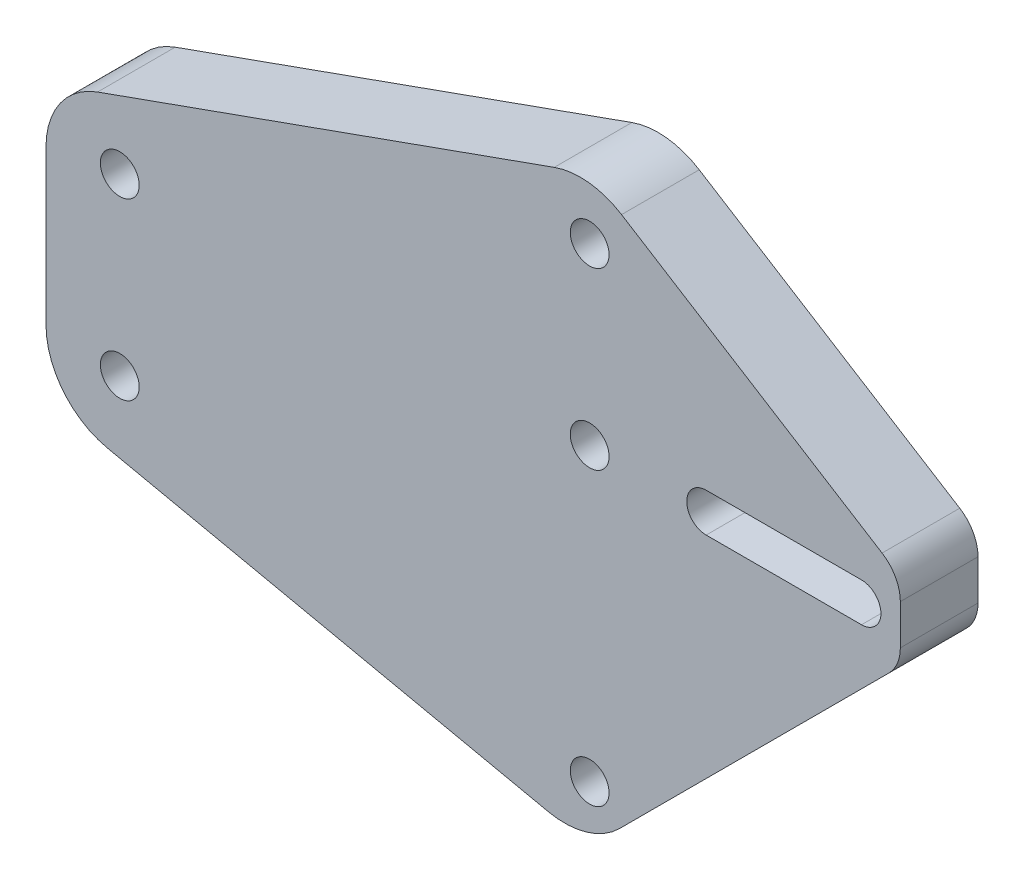
ISO-10303-21;
HEADER;
FILE_DESCRIPTION(('STEP AP214'),'2;1');
FILE_NAME('part.step','',(''),(''),'','','');
FILE_SCHEMA(('AUTOMOTIVE_DESIGN { 1 0 10303 214 1 1 1 1 }'));
ENDSEC;
DATA;
#1=APPLICATION_CONTEXT('core data for automotive mechanical design processes');
#2=APPLICATION_PROTOCOL_DEFINITION('international standard','automotive_design',2000,#1);
#3=PRODUCT_CONTEXT('',#1,'mechanical');
#4=PRODUCT('Part','Part','',(#3));
#5=PRODUCT_RELATED_PRODUCT_CATEGORY('part','',(#4));
#6=PRODUCT_DEFINITION_FORMATION('','',#4);
#7=PRODUCT_DEFINITION_CONTEXT('part definition',#1,'design');
#8=PRODUCT_DEFINITION('design','',#6,#7);
#9=PRODUCT_DEFINITION_SHAPE('','',#8);
#10=(LENGTH_UNIT() NAMED_UNIT(*) SI_UNIT(.MILLI.,.METRE.));
#11=(NAMED_UNIT(*) PLANE_ANGLE_UNIT() SI_UNIT($,.RADIAN.));
#12=(NAMED_UNIT(*) SI_UNIT($,.STERADIAN.) SOLID_ANGLE_UNIT());
#13=UNCERTAINTY_MEASURE_WITH_UNIT(LENGTH_MEASURE(1.E-05),#10,'distance_accuracy_value','');
#14=(GEOMETRIC_REPRESENTATION_CONTEXT(3) GLOBAL_UNCERTAINTY_ASSIGNED_CONTEXT((#13)) GLOBAL_UNIT_ASSIGNED_CONTEXT((#10,
#11,#12)) REPRESENTATION_CONTEXT('',''));
#15=CARTESIAN_POINT('',(0.,0.,0.));
#16=DIRECTION('',(0.,0.,1.));
#17=DIRECTION('',(1.,0.,0.));
#18=AXIS2_PLACEMENT_3D('',#15,#16,#17);
#19=CARTESIAN_POINT('',(-41.1951987154768,23.9545227821022,10.));
#20=DIRECTION('',(0.,0.,1.));
#21=DIRECTION('',(1.,0.,0.));
#22=AXIS2_PLACEMENT_3D('',#19,#20,#21);
#23=PLANE('',#22);
#24=CARTESIAN_POINT('',(-100.5,-17.850085197835,10.));
#25=DIRECTION('',(0.,0.,1.));
#26=DIRECTION('',(1.,0.,0.));
#27=AXIS2_PLACEMENT_3D('',#24,#25,#26);
#28=CIRCLE('',#27,2.5);
#29=CARTESIAN_POINT('',(-98.,-17.850085197835,10.));
#30=VERTEX_POINT('',#29);
#31=EDGE_CURVE('E601',#30,#30,#28,.T.);
#32=ORIENTED_EDGE('',*,*,#31,.F.);
#33=EDGE_LOOP('',(#32));
#34=FACE_BOUND('',#33,.T.);
#35=CARTESIAN_POINT('',(-40.,27.149914802165,10.));
#36=DIRECTION('',(0.,0.,1.));
#37=DIRECTION('',(1.,0.,0.));
#38=AXIS2_PLACEMENT_3D('',#35,#36,#37);
#39=CIRCLE('',#38,2.5);
#40=CARTESIAN_POINT('',(-37.5,27.149914802165,10.));
#41=VERTEX_POINT('',#40);
#42=EDGE_CURVE('E188',#41,#41,#39,.T.);
#43=ORIENTED_EDGE('',*,*,#42,.F.);
#44=EDGE_LOOP('',(#43));
#45=FACE_BOUND('',#44,.T.);
#46=CARTESIAN_POINT('',(-41.1951987154768,23.9545227821022,10.));
#47=DIRECTION('',(0.,0.,1.));
#48=DIRECTION('',(1.,0.,0.));
#49=AXIS2_PLACEMENT_3D('',#46,#47,#48);
#50=CIRCLE('',#49,10.);
#51=CARTESIAN_POINT('',(-35.895209315445,32.4345058221531,10.));
#52=VERTEX_POINT('',#51);
#53=CARTESIAN_POINT('',(-44.5585626854584,33.3719418980506,10.));
#54=VERTEX_POINT('',#53);
#55=EDGE_CURVE('E212',#52,#54,#50,.T.);
#56=ORIENTED_EDGE('',*,*,#55,.T.);
#57=DIRECTION('',(-0.941741911594837,-0.336336396998156,0.));
#58=VECTOR('',#57,1.);
#59=CARTESIAN_POINT('',(-44.5585626854584,33.3719418980506,10.));
#60=LINE('',#59,#58);
#61=CARTESIAN_POINT('',(-103.363363969982,12.370227153578,10.));
#62=VERTEX_POINT('',#61);
#63=EDGE_CURVE('E216',#54,#62,#60,.T.);
#64=ORIENTED_EDGE('',*,*,#63,.T.);
#65=CARTESIAN_POINT('',(-100.,2.95280803762964,10.));
#66=DIRECTION('',(0.,0.,1.));
#67=DIRECTION('',(1.,0.,0.));
#68=AXIS2_PLACEMENT_3D('',#65,#66,#67);
#69=CIRCLE('',#68,9.99999999999998);
#70=CARTESIAN_POINT('',(-110.,2.95280803762964,10.));
#71=VERTEX_POINT('',#70);
#72=EDGE_CURVE('E220',#62,#71,#69,.T.);
#73=ORIENTED_EDGE('',*,*,#72,.T.);
#74=DIRECTION('',(0.,-1.,0.));
#75=VECTOR('',#74,1.);
#76=CARTESIAN_POINT('',(-110.,2.95280803762964,10.));
#77=LINE('',#76,#75);
#78=CARTESIAN_POINT('',(-110.,-16.9158420976597,10.));
#79=VERTEX_POINT('',#78);
#80=EDGE_CURVE('E223',#71,#79,#77,.T.);
#81=ORIENTED_EDGE('',*,*,#80,.T.);
#82=CARTESIAN_POINT('',(-100.,-16.9158420976597,10.));
#83=DIRECTION('',(0.,0.,1.));
#84=DIRECTION('',(1.,0.,0.));
#85=AXIS2_PLACEMENT_3D('',#82,#83,#84);
#86=CIRCLE('',#85,10.);
#87=CARTESIAN_POINT('',(-102.095290887309,-26.6938662384338,10.));
#88=VERTEX_POINT('',#87);
#89=EDGE_CURVE('E226',#79,#88,#86,.T.);
#90=ORIENTED_EDGE('',*,*,#89,.T.);
#91=DIRECTION('',(0.97780241407741,-0.209529088730873,0.));
#92=VECTOR('',#91,1.);
#93=CARTESIAN_POINT('',(-102.095290887309,-26.6938662384338,10.));
#94=LINE('',#93,#92);
#95=CARTESIAN_POINT('',(-45.3195078343364,-38.8601054640708,10.));
#96=VERTEX_POINT('',#95);
#97=EDGE_CURVE('E229',#88,#96,#94,.T.);
#98=ORIENTED_EDGE('',*,*,#97,.T.);
#99=CARTESIAN_POINT('',(-43.2242169470276,-29.0820813232967,10.));
#100=DIRECTION('',(0.,0.,1.));
#101=DIRECTION('',(1.,0.,0.));
#102=AXIS2_PLACEMENT_3D('',#99,#100,#101);
#103=CIRCLE('',#102,10.);
#104=CARTESIAN_POINT('',(-36.1531491351622,-36.1531491351622,10.));
#105=VERTEX_POINT('',#104);
#106=EDGE_CURVE('E232',#96,#105,#103,.T.);
#107=ORIENTED_EDGE('',*,*,#106,.T.);
#108=DIRECTION('',(0.707106781186547,0.707106781186548,0.));
#109=VECTOR('',#108,1.);
#110=CARTESIAN_POINT('',(-36.1531491351622,-36.1531491351622,10.));
#111=LINE('',#110,#109);
#112=CARTESIAN_POINT('',(-1.46446609406726,-1.46446609406727,10.));
#113=VERTEX_POINT('',#112);
#114=EDGE_CURVE('E235',#105,#113,#111,.T.);
#115=ORIENTED_EDGE('',*,*,#114,.T.);
#116=CARTESIAN_POINT('',(-5.,2.07106781186547,10.));
#117=DIRECTION('',(0.,0.,1.));
#118=DIRECTION('',(-1.,0.,0.));
#119=AXIS2_PLACEMENT_3D('',#116,#117,#118);
#120=CIRCLE('',#119,5.);
#121=CARTESIAN_POINT('',(0.,2.07106781186547,10.));
#122=VERTEX_POINT('',#121);
#123=EDGE_CURVE('E238',#113,#122,#120,.T.);
#124=ORIENTED_EDGE('',*,*,#123,.T.);
#125=DIRECTION('',(0.,1.,0.));
#126=VECTOR('',#125,1.);
#127=CARTESIAN_POINT('',(0.,7.22876179246463,10.));
#128=LINE('',#127,#126);
#129=CARTESIAN_POINT('',(0.,7.22876179246463,10.));
#130=VERTEX_POINT('',#129);
#131=EDGE_CURVE('E241',#122,#130,#128,.T.);
#132=ORIENTED_EDGE('',*,*,#131,.T.);
#133=CARTESIAN_POINT('',(-5.,7.22876179246463,10.));
#134=DIRECTION('',(0.,0.,1.));
#135=DIRECTION('',(-1.,0.,0.));
#136=AXIS2_PLACEMENT_3D('',#133,#134,#135);
#137=CIRCLE('',#136,5.);
#138=CARTESIAN_POINT('',(-2.3500052999841,11.4687533124901,10.));
#139=VERTEX_POINT('',#138);
#140=EDGE_CURVE('E244',#130,#139,#137,.T.);
#141=ORIENTED_EDGE('',*,*,#140,.T.);
#142=DIRECTION('',(-0.847998304005088,0.52999894000318,0.));
#143=VECTOR('',#142,1.);
#144=CARTESIAN_POINT('',(-35.895209315445,32.4345058221531,10.));
#145=LINE('',#144,#143);
#146=EDGE_CURVE('E247',#139,#52,#145,.T.);
#147=ORIENTED_EDGE('',*,*,#146,.T.);
#148=EDGE_LOOP('',(#56,#64,#73,#81,#90,#98,#107,#115,#124,#132,#141,#147));
#149=FACE_BOUND('',#148,.T.);
#150=CARTESIAN_POINT('',(-40.,4.64991480216505,10.));
#151=DIRECTION('',(0.,0.,1.));
#152=DIRECTION('',(1.,0.,0.));
#153=AXIS2_PLACEMENT_3D('',#150,#151,#152);
#154=CIRCLE('',#153,2.5);
#155=CARTESIAN_POINT('',(-37.5,4.64991480216505,10.));
#156=VERTEX_POINT('',#155);
#157=EDGE_CURVE('E204',#156,#156,#154,.T.);
#158=ORIENTED_EDGE('',*,*,#157,.F.);
#159=EDGE_LOOP('',(#158));
#160=FACE_BOUND('',#159,.T.);
#161=DIRECTION('',(1.,0.,0.));
#162=VECTOR('',#161,1.);
#163=CARTESIAN_POINT('',(-25.,2.14991480216505,10.));
#164=LINE('',#163,#162);
#165=CARTESIAN_POINT('',(-25.,2.14991480216505,10.));
#166=VERTEX_POINT('',#165);
#167=CARTESIAN_POINT('',(-5.,2.14991480216504,10.));
#168=VERTEX_POINT('',#167);
#169=EDGE_CURVE('E162',#166,#168,#164,.T.);
#170=ORIENTED_EDGE('',*,*,#169,.F.);
#171=CARTESIAN_POINT('',(-25.,4.64991480216505,10.));
#172=DIRECTION('',(0.,0.,1.));
#173=DIRECTION('',(1.,0.,0.));
#174=AXIS2_PLACEMENT_3D('',#171,#172,#173);
#175=CIRCLE('',#174,2.5);
#176=CARTESIAN_POINT('',(-25.,7.14991480216505,10.));
#177=VERTEX_POINT('',#176);
#178=EDGE_CURVE('E153',#177,#166,#175,.T.);
#179=ORIENTED_EDGE('',*,*,#178,.F.);
#180=DIRECTION('',(-1.,0.,0.));
#181=VECTOR('',#180,1.);
#182=CARTESIAN_POINT('',(-25.,7.14991480216505,10.));
#183=LINE('',#182,#181);
#184=CARTESIAN_POINT('',(-5.,7.14991480216505,10.));
#185=VERTEX_POINT('',#184);
#186=EDGE_CURVE('E180',#185,#177,#183,.T.);
#187=ORIENTED_EDGE('',*,*,#186,.F.);
#188=CARTESIAN_POINT('',(-5.,4.64991480216505,10.));
#189=DIRECTION('',(0.,0.,1.));
#190=DIRECTION('',(1.,0.,0.));
#191=AXIS2_PLACEMENT_3D('',#188,#189,#190);
#192=CIRCLE('',#191,2.5);
#193=EDGE_CURVE('E176',#168,#185,#192,.T.);
#194=ORIENTED_EDGE('',*,*,#193,.F.);
#195=EDGE_LOOP('',(#170,#179,#187,#194));
#196=FACE_BOUND('',#195,.T.);
#197=CARTESIAN_POINT('',(-100.5,4.64991480216505,10.));
#198=DIRECTION('',(0.,0.,1.));
#199=DIRECTION('',(1.,0.,0.));
#200=AXIS2_PLACEMENT_3D('',#197,#198,#199);
#201=CIRCLE('',#200,2.5);
#202=CARTESIAN_POINT('',(-98.,4.64991480216505,10.));
#203=VERTEX_POINT('',#202);
#204=EDGE_CURVE('E609',#203,#203,#201,.T.);
#205=ORIENTED_EDGE('',*,*,#204,.F.);
#206=EDGE_LOOP('',(#205));
#207=FACE_BOUND('',#206,.T.);
#208=CARTESIAN_POINT('',(-40.,-32.850085197835,10.));
#209=DIRECTION('',(0.,0.,1.));
#210=DIRECTION('',(1.,0.,0.));
#211=AXIS2_PLACEMENT_3D('',#208,#209,#210);
#212=CIRCLE('',#211,2.5);
#213=CARTESIAN_POINT('',(-37.5,-32.850085197835,10.));
#214=VERTEX_POINT('',#213);
#215=EDGE_CURVE('E590',#214,#214,#212,.T.);
#216=ORIENTED_EDGE('',*,*,#215,.F.);
#217=EDGE_LOOP('',(#216));
#218=FACE_BOUND('',#217,.T.);
#219=ADVANCED_FACE('F39',(#34,#45,#149,#160,#196,#207,#218),#23,.T.);
#220=CARTESIAN_POINT('',(-41.1951987154768,23.9545227821022,0.));
#221=DIRECTION('',(0.,0.,1.));
#222=DIRECTION('',(1.,0.,0.));
#223=AXIS2_PLACEMENT_3D('',#220,#221,#222);
#224=PLANE('',#223);
#225=CARTESIAN_POINT('',(-40.,4.64991480216505,0.));
#226=DIRECTION('',(0.,0.,1.));
#227=DIRECTION('',(1.,0.,0.));
#228=AXIS2_PLACEMENT_3D('',#225,#226,#227);
#229=CIRCLE('',#228,2.5);
#230=CARTESIAN_POINT('',(-37.5,4.64991480216505,0.));
#231=VERTEX_POINT('',#230);
#232=EDGE_CURVE('E171',#231,#231,#229,.T.);
#233=ORIENTED_EDGE('',*,*,#232,.T.);
#234=EDGE_LOOP('',(#233));
#235=FACE_BOUND('',#234,.T.);
#236=CARTESIAN_POINT('',(-41.1951987154768,23.9545227821022,0.));
#237=DIRECTION('',(0.,0.,1.));
#238=DIRECTION('',(1.,0.,0.));
#239=AXIS2_PLACEMENT_3D('',#236,#237,#238);
#240=CIRCLE('',#239,10.);
#241=CARTESIAN_POINT('',(-35.895209315445,32.4345058221531,0.));
#242=VERTEX_POINT('',#241);
#243=CARTESIAN_POINT('',(-44.5585626854584,33.3719418980506,0.));
#244=VERTEX_POINT('',#243);
#245=EDGE_CURVE('E208',#242,#244,#240,.T.);
#246=ORIENTED_EDGE('',*,*,#245,.F.);
#247=DIRECTION('',(-0.847998304005088,0.52999894000318,0.));
#248=VECTOR('',#247,1.);
#249=CARTESIAN_POINT('',(-35.895209315445,32.4345058221531,0.));
#250=LINE('',#249,#248);
#251=CARTESIAN_POINT('',(-2.3500052999841,11.4687533124901,0.));
#252=VERTEX_POINT('',#251);
#253=EDGE_CURVE('E217',#252,#242,#250,.T.);
#254=ORIENTED_EDGE('',*,*,#253,.F.);
#255=CARTESIAN_POINT('',(-5.,7.22876179246463,0.));
#256=DIRECTION('',(0.,0.,1.));
#257=DIRECTION('',(-1.,0.,0.));
#258=AXIS2_PLACEMENT_3D('',#255,#256,#257);
#259=CIRCLE('',#258,5.);
#260=CARTESIAN_POINT('',(0.,7.22876179246463,0.));
#261=VERTEX_POINT('',#260);
#262=EDGE_CURVE('E281',#261,#252,#259,.T.);
#263=ORIENTED_EDGE('',*,*,#262,.F.);
#264=DIRECTION('',(0.,1.,0.));
#265=VECTOR('',#264,1.);
#266=CARTESIAN_POINT('',(0.,7.22876179246463,0.));
#267=LINE('',#266,#265);
#268=CARTESIAN_POINT('',(0.,2.07106781186547,0.));
#269=VERTEX_POINT('',#268);
#270=EDGE_CURVE('E278',#269,#261,#267,.T.);
#271=ORIENTED_EDGE('',*,*,#270,.F.);
#272=CARTESIAN_POINT('',(-5.,2.07106781186547,0.));
#273=DIRECTION('',(0.,0.,1.));
#274=DIRECTION('',(-1.,0.,0.));
#275=AXIS2_PLACEMENT_3D('',#272,#273,#274);
#276=CIRCLE('',#275,5.);
#277=CARTESIAN_POINT('',(-1.46446609406726,-1.46446609406727,0.));
#278=VERTEX_POINT('',#277);
#279=EDGE_CURVE('E275',#278,#269,#276,.T.);
#280=ORIENTED_EDGE('',*,*,#279,.F.);
#281=DIRECTION('',(0.707106781186547,0.707106781186548,0.));
#282=VECTOR('',#281,1.);
#283=CARTESIAN_POINT('',(-36.1531491351622,-36.1531491351622,0.));
#284=LINE('',#283,#282);
#285=CARTESIAN_POINT('',(-36.1531491351622,-36.1531491351622,0.));
#286=VERTEX_POINT('',#285);
#287=EDGE_CURVE('E272',#286,#278,#284,.T.);
#288=ORIENTED_EDGE('',*,*,#287,.F.);
#289=CARTESIAN_POINT('',(-43.2242169470276,-29.0820813232967,0.));
#290=DIRECTION('',(0.,0.,1.));
#291=DIRECTION('',(1.,0.,0.));
#292=AXIS2_PLACEMENT_3D('',#289,#290,#291);
#293=CIRCLE('',#292,10.);
#294=CARTESIAN_POINT('',(-45.3195078343364,-38.8601054640708,0.));
#295=VERTEX_POINT('',#294);
#296=EDGE_CURVE('E269',#295,#286,#293,.T.);
#297=ORIENTED_EDGE('',*,*,#296,.F.);
#298=DIRECTION('',(0.97780241407741,-0.209529088730873,0.));
#299=VECTOR('',#298,1.);
#300=CARTESIAN_POINT('',(-102.095290887309,-26.6938662384338,0.));
#301=LINE('',#300,#299);
#302=CARTESIAN_POINT('',(-102.095290887309,-26.6938662384338,0.));
#303=VERTEX_POINT('',#302);
#304=EDGE_CURVE('E266',#303,#295,#301,.T.);
#305=ORIENTED_EDGE('',*,*,#304,.F.);
#306=CARTESIAN_POINT('',(-100.,-16.9158420976597,0.));
#307=DIRECTION('',(0.,0.,1.));
#308=DIRECTION('',(1.,0.,0.));
#309=AXIS2_PLACEMENT_3D('',#306,#307,#308);
#310=CIRCLE('',#309,10.);
#311=CARTESIAN_POINT('',(-110.,-16.9158420976597,0.));
#312=VERTEX_POINT('',#311);
#313=EDGE_CURVE('E263',#312,#303,#310,.T.);
#314=ORIENTED_EDGE('',*,*,#313,.F.);
#315=DIRECTION('',(0.,-1.,0.));
#316=VECTOR('',#315,1.);
#317=CARTESIAN_POINT('',(-110.,2.95280803762964,0.));
#318=LINE('',#317,#316);
#319=CARTESIAN_POINT('',(-110.,2.95280803762964,0.));
#320=VERTEX_POINT('',#319);
#321=EDGE_CURVE('E260',#320,#312,#318,.T.);
#322=ORIENTED_EDGE('',*,*,#321,.F.);
#323=CARTESIAN_POINT('',(-100.,2.95280803762964,0.));
#324=DIRECTION('',(0.,0.,1.));
#325=DIRECTION('',(1.,0.,0.));
#326=AXIS2_PLACEMENT_3D('',#323,#324,#325);
#327=CIRCLE('',#326,9.99999999999998);
#328=CARTESIAN_POINT('',(-103.363363969982,12.370227153578,0.));
#329=VERTEX_POINT('',#328);
#330=EDGE_CURVE('E257',#329,#320,#327,.T.);
#331=ORIENTED_EDGE('',*,*,#330,.F.);
#332=DIRECTION('',(-0.941741911594837,-0.336336396998156,0.));
#333=VECTOR('',#332,1.);
#334=CARTESIAN_POINT('',(-44.5585626854584,33.3719418980506,0.));
#335=LINE('',#334,#333);
#336=EDGE_CURVE('E254',#244,#329,#335,.T.);
#337=ORIENTED_EDGE('',*,*,#336,.F.);
#338=EDGE_LOOP('',(#246,#254,#263,#271,#280,#288,#297,#305,#314,#322,#331,#337));
#339=FACE_BOUND('',#338,.T.);
#340=CARTESIAN_POINT('',(-25.,4.64991480216505,0.));
#341=DIRECTION('',(0.,0.,1.));
#342=DIRECTION('',(1.,0.,0.));
#343=AXIS2_PLACEMENT_3D('',#340,#341,#342);
#344=CIRCLE('',#343,2.5);
#345=CARTESIAN_POINT('',(-25.,7.14991480216505,0.));
#346=VERTEX_POINT('',#345);
#347=CARTESIAN_POINT('',(-25.,2.14991480216505,0.));
#348=VERTEX_POINT('',#347);
#349=EDGE_CURVE('E63',#346,#348,#344,.T.);
#350=ORIENTED_EDGE('',*,*,#349,.T.);
#351=DIRECTION('',(1.,0.,0.));
#352=VECTOR('',#351,1.);
#353=CARTESIAN_POINT('',(-25.,2.14991480216505,0.));
#354=LINE('',#353,#352);
#355=CARTESIAN_POINT('',(-5.,2.14991480216504,0.));
#356=VERTEX_POINT('',#355);
#357=EDGE_CURVE('E169',#348,#356,#354,.T.);
#358=ORIENTED_EDGE('',*,*,#357,.T.);
#359=CARTESIAN_POINT('',(-5.,4.64991480216505,0.));
#360=DIRECTION('',(0.,0.,1.));
#361=DIRECTION('',(1.,0.,0.));
#362=AXIS2_PLACEMENT_3D('',#359,#360,#361);
#363=CIRCLE('',#362,2.5);
#364=CARTESIAN_POINT('',(-5.,7.14991480216505,0.));
#365=VERTEX_POINT('',#364);
#366=EDGE_CURVE('E191',#356,#365,#363,.T.);
#367=ORIENTED_EDGE('',*,*,#366,.T.);
#368=DIRECTION('',(-1.,0.,0.));
#369=VECTOR('',#368,1.);
#370=CARTESIAN_POINT('',(-25.,7.14991480216505,0.));
#371=LINE('',#370,#369);
#372=EDGE_CURVE('E163',#365,#346,#371,.T.);
#373=ORIENTED_EDGE('',*,*,#372,.T.);
#374=EDGE_LOOP('',(#350,#358,#367,#373));
#375=FACE_BOUND('',#374,.T.);
#376=CARTESIAN_POINT('',(-40.,27.149914802165,0.));
#377=DIRECTION('',(0.,0.,1.));
#378=DIRECTION('',(1.,0.,0.));
#379=AXIS2_PLACEMENT_3D('',#376,#377,#378);
#380=CIRCLE('',#379,2.5);
#381=CARTESIAN_POINT('',(-37.5,27.149914802165,0.));
#382=VERTEX_POINT('',#381);
#383=EDGE_CURVE('E613',#382,#382,#380,.T.);
#384=ORIENTED_EDGE('',*,*,#383,.T.);
#385=EDGE_LOOP('',(#384));
#386=FACE_BOUND('',#385,.T.);
#387=CARTESIAN_POINT('',(-100.5,4.64991480216505,0.));
#388=DIRECTION('',(0.,0.,1.));
#389=DIRECTION('',(1.,0.,0.));
#390=AXIS2_PLACEMENT_3D('',#387,#388,#389);
#391=CIRCLE('',#390,2.5);
#392=CARTESIAN_POINT('',(-98.,4.64991480216505,0.));
#393=VERTEX_POINT('',#392);
#394=EDGE_CURVE('E605',#393,#393,#391,.T.);
#395=ORIENTED_EDGE('',*,*,#394,.T.);
#396=EDGE_LOOP('',(#395));
#397=FACE_BOUND('',#396,.T.);
#398=CARTESIAN_POINT('',(-100.5,-17.850085197835,0.));
#399=DIRECTION('',(0.,0.,1.));
#400=DIRECTION('',(1.,0.,0.));
#401=AXIS2_PLACEMENT_3D('',#398,#399,#400);
#402=CIRCLE('',#401,2.5);
#403=CARTESIAN_POINT('',(-98.,-17.850085197835,0.));
#404=VERTEX_POINT('',#403);
#405=EDGE_CURVE('E598',#404,#404,#402,.T.);
#406=ORIENTED_EDGE('',*,*,#405,.T.);
#407=EDGE_LOOP('',(#406));
#408=FACE_BOUND('',#407,.T.);
#409=CARTESIAN_POINT('',(-40.,-32.850085197835,0.));
#410=DIRECTION('',(0.,0.,1.));
#411=DIRECTION('',(1.,0.,0.));
#412=AXIS2_PLACEMENT_3D('',#409,#410,#411);
#413=CIRCLE('',#412,2.5);
#414=CARTESIAN_POINT('',(-37.5,-32.850085197835,0.));
#415=VERTEX_POINT('',#414);
#416=EDGE_CURVE('E593',#415,#415,#413,.T.);
#417=ORIENTED_EDGE('',*,*,#416,.T.);
#418=EDGE_LOOP('',(#417));
#419=FACE_BOUND('',#418,.T.);
#420=ADVANCED_FACE('F336',(#235,#339,#375,#386,#397,#408,#419),#224,.F.);
#421=CARTESIAN_POINT('',(-41.1951987154768,23.9545227821022,10.));
#422=DIRECTION('',(0.,0.,-1.));
#423=DIRECTION('',(-1.,0.,0.));
#424=AXIS2_PLACEMENT_3D('',#421,#422,#423);
#425=CYLINDRICAL_SURFACE('',#424,10.);
#426=ORIENTED_EDGE('',*,*,#245,.T.);
#427=DIRECTION('',(0.,0.,-1.));
#428=VECTOR('',#427,1.);
#429=CARTESIAN_POINT('',(-44.5585626854584,33.3719418980506,10.));
#430=LINE('',#429,#428);
#431=EDGE_CURVE('E11',#54,#244,#430,.T.);
#432=ORIENTED_EDGE('',*,*,#431,.F.);
#433=ORIENTED_EDGE('',*,*,#55,.F.);
#434=DIRECTION('',(0.,0.,-1.));
#435=VECTOR('',#434,1.);
#436=CARTESIAN_POINT('',(-35.895209315445,32.4345058221531,10.));
#437=LINE('',#436,#435);
#438=EDGE_CURVE('E250',#52,#242,#437,.T.);
#439=ORIENTED_EDGE('',*,*,#438,.T.);
#440=EDGE_LOOP('',(#426,#432,#433,#439));
#441=FACE_BOUND('',#440,.T.);
#442=ADVANCED_FACE('F41',(#441),#425,.T.);
#443=CARTESIAN_POINT('',(-44.5585626854584,33.3719418980506,10.));
#444=DIRECTION('',(0.336336396998156,-0.941741911594837,0.));
#445=DIRECTION('',(0.941741911594837,0.336336396998156,0.));
#446=AXIS2_PLACEMENT_3D('',#443,#444,#445);
#447=PLANE('',#446);
#448=ORIENTED_EDGE('',*,*,#336,.T.);
#449=DIRECTION('',(0.,0.,-1.));
#450=VECTOR('',#449,1.);
#451=CARTESIAN_POINT('',(-103.363363969982,12.370227153578,10.));
#452=LINE('',#451,#450);
#453=EDGE_CURVE('E48',#62,#329,#452,.T.);
#454=ORIENTED_EDGE('',*,*,#453,.F.);
#455=ORIENTED_EDGE('',*,*,#63,.F.);
#456=ORIENTED_EDGE('',*,*,#431,.T.);
#457=EDGE_LOOP('',(#448,#454,#455,#456));
#458=FACE_BOUND('',#457,.T.);
#459=ADVANCED_FACE('F354',(#458),#447,.F.);
#460=CARTESIAN_POINT('',(-100.,2.95280803762964,10.));
#461=DIRECTION('',(0.,0.,-1.));
#462=DIRECTION('',(-1.,0.,0.));
#463=AXIS2_PLACEMENT_3D('',#460,#461,#462);
#464=CYLINDRICAL_SURFACE('',#463,9.99999999999998);
#465=ORIENTED_EDGE('',*,*,#330,.T.);
#466=DIRECTION('',(0.,0.,-1.));
#467=VECTOR('',#466,1.);
#468=CARTESIAN_POINT('',(-110.,2.95280803762964,10.));
#469=LINE('',#468,#467);
#470=EDGE_CURVE('E321',#71,#320,#469,.T.);
#471=ORIENTED_EDGE('',*,*,#470,.F.);
#472=ORIENTED_EDGE('',*,*,#72,.F.);
#473=ORIENTED_EDGE('',*,*,#453,.T.);
#474=EDGE_LOOP('',(#465,#471,#472,#473));
#475=FACE_BOUND('',#474,.T.);
#476=ADVANCED_FACE('F330',(#475),#464,.T.);
#477=CARTESIAN_POINT('',(-110.,2.95280803762964,10.));
#478=DIRECTION('',(1.,0.,0.));
#479=DIRECTION('',(0.,1.,0.));
#480=AXIS2_PLACEMENT_3D('',#477,#478,#479);
#481=PLANE('',#480);
#482=ORIENTED_EDGE('',*,*,#321,.T.);
#483=DIRECTION('',(0.,0.,-1.));
#484=VECTOR('',#483,1.);
#485=CARTESIAN_POINT('',(-110.,-16.9158420976597,10.));
#486=LINE('',#485,#484);
#487=EDGE_CURVE('E317',#79,#312,#486,.T.);
#488=ORIENTED_EDGE('',*,*,#487,.F.);
#489=ORIENTED_EDGE('',*,*,#80,.F.);
#490=ORIENTED_EDGE('',*,*,#470,.T.);
#491=EDGE_LOOP('',(#482,#488,#489,#490));
#492=FACE_BOUND('',#491,.T.);
#493=ADVANCED_FACE('F342',(#492),#481,.F.);
#494=CARTESIAN_POINT('',(-100.,-16.9158420976597,10.));
#495=DIRECTION('',(0.,0.,-1.));
#496=DIRECTION('',(-1.,0.,0.));
#497=AXIS2_PLACEMENT_3D('',#494,#495,#496);
#498=CYLINDRICAL_SURFACE('',#497,10.);
#499=ORIENTED_EDGE('',*,*,#313,.T.);
#500=DIRECTION('',(0.,0.,-1.));
#501=VECTOR('',#500,1.);
#502=CARTESIAN_POINT('',(-102.095290887309,-26.6938662384338,10.));
#503=LINE('',#502,#501);
#504=EDGE_CURVE('E313',#88,#303,#503,.T.);
#505=ORIENTED_EDGE('',*,*,#504,.F.);
#506=ORIENTED_EDGE('',*,*,#89,.F.);
#507=ORIENTED_EDGE('',*,*,#487,.T.);
#508=EDGE_LOOP('',(#499,#505,#506,#507));
#509=FACE_BOUND('',#508,.T.);
#510=ADVANCED_FACE('F346',(#509),#498,.T.);
#511=CARTESIAN_POINT('',(-102.095290887309,-26.6938662384338,10.));
#512=DIRECTION('',(0.209529088730873,0.97780241407741,0.));
#513=DIRECTION('',(-0.97780241407741,0.209529088730873,0.));
#514=AXIS2_PLACEMENT_3D('',#511,#512,#513);
#515=PLANE('',#514);
#516=ORIENTED_EDGE('',*,*,#304,.T.);
#517=DIRECTION('',(0.,0.,-1.));
#518=VECTOR('',#517,1.);
#519=CARTESIAN_POINT('',(-45.3195078343364,-38.8601054640708,10.));
#520=LINE('',#519,#518);
#521=EDGE_CURVE('E309',#96,#295,#520,.T.);
#522=ORIENTED_EDGE('',*,*,#521,.F.);
#523=ORIENTED_EDGE('',*,*,#97,.F.);
#524=ORIENTED_EDGE('',*,*,#504,.T.);
#525=EDGE_LOOP('',(#516,#522,#523,#524));
#526=FACE_BOUND('',#525,.T.);
#527=ADVANCED_FACE('F387',(#526),#515,.F.);
#528=CARTESIAN_POINT('',(-43.2242169470276,-29.0820813232967,10.));
#529=DIRECTION('',(0.,0.,-1.));
#530=DIRECTION('',(-1.,0.,0.));
#531=AXIS2_PLACEMENT_3D('',#528,#529,#530);
#532=CYLINDRICAL_SURFACE('',#531,10.);
#533=ORIENTED_EDGE('',*,*,#296,.T.);
#534=DIRECTION('',(0.,0.,-1.));
#535=VECTOR('',#534,1.);
#536=CARTESIAN_POINT('',(-36.1531491351622,-36.1531491351622,10.));
#537=LINE('',#536,#535);
#538=EDGE_CURVE('E305',#105,#286,#537,.T.);
#539=ORIENTED_EDGE('',*,*,#538,.F.);
#540=ORIENTED_EDGE('',*,*,#106,.F.);
#541=ORIENTED_EDGE('',*,*,#521,.T.);
#542=EDGE_LOOP('',(#533,#539,#540,#541));
#543=FACE_BOUND('',#542,.T.);
#544=ADVANCED_FACE('F385',(#543),#532,.T.);
#545=CARTESIAN_POINT('',(-36.1531491351622,-36.1531491351622,10.));
#546=DIRECTION('',(-0.707106781186548,0.707106781186547,0.));
#547=DIRECTION('',(-0.707106781186547,-0.707106781186548,0.));
#548=AXIS2_PLACEMENT_3D('',#545,#546,#547);
#549=PLANE('',#548);
#550=ORIENTED_EDGE('',*,*,#287,.T.);
#551=DIRECTION('',(0.,0.,-1.));
#552=VECTOR('',#551,1.);
#553=CARTESIAN_POINT('',(-1.46446609406726,-1.46446609406727,10.));
#554=LINE('',#553,#552);
#555=EDGE_CURVE('E301',#113,#278,#554,.T.);
#556=ORIENTED_EDGE('',*,*,#555,.F.);
#557=ORIENTED_EDGE('',*,*,#114,.F.);
#558=ORIENTED_EDGE('',*,*,#538,.T.);
#559=EDGE_LOOP('',(#550,#556,#557,#558));
#560=FACE_BOUND('',#559,.T.);
#561=ADVANCED_FACE('F381',(#560),#549,.F.);
#562=CARTESIAN_POINT('',(-5.,2.07106781186547,10.));
#563=DIRECTION('',(0.,0.,-1.));
#564=DIRECTION('',(-1.,0.,0.));
#565=AXIS2_PLACEMENT_3D('',#562,#563,#564);
#566=CYLINDRICAL_SURFACE('',#565,5.);
#567=ORIENTED_EDGE('',*,*,#279,.T.);
#568=DIRECTION('',(0.,0.,-1.));
#569=VECTOR('',#568,1.);
#570=CARTESIAN_POINT('',(0.,2.07106781186547,10.));
#571=LINE('',#570,#569);
#572=EDGE_CURVE('E297',#122,#269,#571,.T.);
#573=ORIENTED_EDGE('',*,*,#572,.F.);
#574=ORIENTED_EDGE('',*,*,#123,.F.);
#575=ORIENTED_EDGE('',*,*,#555,.T.);
#576=EDGE_LOOP('',(#567,#573,#574,#575));
#577=FACE_BOUND('',#576,.T.);
#578=ADVANCED_FACE('F376',(#577),#566,.T.);
#579=CARTESIAN_POINT('',(0.,7.22876179246463,10.));
#580=DIRECTION('',(-1.,0.,0.));
#581=DIRECTION('',(0.,0.,1.));
#582=AXIS2_PLACEMENT_3D('',#579,#580,#581);
#583=PLANE('',#582);
#584=ORIENTED_EDGE('',*,*,#270,.T.);
#585=DIRECTION('',(0.,0.,-1.));
#586=VECTOR('',#585,1.);
#587=CARTESIAN_POINT('',(0.,7.22876179246463,10.));
#588=LINE('',#587,#586);
#589=EDGE_CURVE('E293',#130,#261,#588,.T.);
#590=ORIENTED_EDGE('',*,*,#589,.F.);
#591=ORIENTED_EDGE('',*,*,#131,.F.);
#592=ORIENTED_EDGE('',*,*,#572,.T.);
#593=EDGE_LOOP('',(#584,#590,#591,#592));
#594=FACE_BOUND('',#593,.T.);
#595=ADVANCED_FACE('F370',(#594),#583,.F.);
#596=CARTESIAN_POINT('',(-5.,7.22876179246463,10.));
#597=DIRECTION('',(0.,0.,-1.));
#598=DIRECTION('',(-1.,0.,0.));
#599=AXIS2_PLACEMENT_3D('',#596,#597,#598);
#600=CYLINDRICAL_SURFACE('',#599,5.);
#601=ORIENTED_EDGE('',*,*,#262,.T.);
#602=DIRECTION('',(0.,0.,-1.));
#603=VECTOR('',#602,1.);
#604=CARTESIAN_POINT('',(-2.3500052999841,11.4687533124901,10.));
#605=LINE('',#604,#603);
#606=EDGE_CURVE('E289',#139,#252,#605,.T.);
#607=ORIENTED_EDGE('',*,*,#606,.F.);
#608=ORIENTED_EDGE('',*,*,#140,.F.);
#609=ORIENTED_EDGE('',*,*,#589,.T.);
#610=EDGE_LOOP('',(#601,#607,#608,#609));
#611=FACE_BOUND('',#610,.T.);
#612=ADVANCED_FACE('F366',(#611),#600,.T.);
#613=CARTESIAN_POINT('',(-35.895209315445,32.4345058221531,10.));
#614=DIRECTION('',(-0.52999894000318,-0.847998304005088,0.));
#615=DIRECTION('',(0.847998304005088,-0.52999894000318,0.));
#616=AXIS2_PLACEMENT_3D('',#613,#614,#615);
#617=PLANE('',#616);
#618=ORIENTED_EDGE('',*,*,#253,.T.);
#619=ORIENTED_EDGE('',*,*,#438,.F.);
#620=ORIENTED_EDGE('',*,*,#146,.F.);
#621=ORIENTED_EDGE('',*,*,#606,.T.);
#622=EDGE_LOOP('',(#618,#619,#620,#621));
#623=FACE_BOUND('',#622,.T.);
#624=ADVANCED_FACE('F361',(#623),#617,.F.);
#625=CARTESIAN_POINT('',(-40.,4.64991480216505,10.));
#626=DIRECTION('',(0.,0.,-1.));
#627=DIRECTION('',(-1.,0.,0.));
#628=AXIS2_PLACEMENT_3D('',#625,#626,#627);
#629=CYLINDRICAL_SURFACE('',#628,2.5);
#630=ORIENTED_EDGE('',*,*,#157,.T.);
#631=EDGE_LOOP('',(#630));
#632=FACE_BOUND('',#631,.T.);
#633=ORIENTED_EDGE('',*,*,#232,.F.);
#634=EDGE_LOOP('',(#633));
#635=FACE_BOUND('',#634,.T.);
#636=ADVANCED_FACE('F407',(#632,#635),#629,.F.);
#637=CARTESIAN_POINT('',(-25.,4.64991480216505,10.));
#638=DIRECTION('',(0.,0.,-1.));
#639=DIRECTION('',(-1.,0.,0.));
#640=AXIS2_PLACEMENT_3D('',#637,#638,#639);
#641=CYLINDRICAL_SURFACE('',#640,2.5);
#642=ORIENTED_EDGE('',*,*,#349,.F.);
#643=DIRECTION('',(0.,0.,-1.));
#644=VECTOR('',#643,1.);
#645=CARTESIAN_POINT('',(-25.,7.14991480216505,10.));
#646=LINE('',#645,#644);
#647=EDGE_CURVE('E157',#177,#346,#646,.T.);
#648=ORIENTED_EDGE('',*,*,#647,.F.);
#649=ORIENTED_EDGE('',*,*,#178,.T.);
#650=DIRECTION('',(0.,0.,-1.));
#651=VECTOR('',#650,1.);
#652=CARTESIAN_POINT('',(-25.,2.14991480216505,10.));
#653=LINE('',#652,#651);
#654=EDGE_CURVE('E156',#166,#348,#653,.T.);
#655=ORIENTED_EDGE('',*,*,#654,.T.);
#656=EDGE_LOOP('',(#642,#648,#649,#655));
#657=FACE_BOUND('',#656,.T.);
#658=ADVANCED_FACE('F155',(#657),#641,.F.);
#659=CARTESIAN_POINT('',(-25.,2.14991480216505,10.));
#660=DIRECTION('',(0.,1.,0.));
#661=DIRECTION('',(0.,0.,1.));
#662=AXIS2_PLACEMENT_3D('',#659,#660,#661);
#663=PLANE('',#662);
#664=ORIENTED_EDGE('',*,*,#357,.F.);
#665=ORIENTED_EDGE('',*,*,#654,.F.);
#666=ORIENTED_EDGE('',*,*,#169,.T.);
#667=DIRECTION('',(0.,0.,-1.));
#668=VECTOR('',#667,1.);
#669=CARTESIAN_POINT('',(-5.,2.14991480216504,10.));
#670=LINE('',#669,#668);
#671=EDGE_CURVE('E172',#168,#356,#670,.T.);
#672=ORIENTED_EDGE('',*,*,#671,.T.);
#673=EDGE_LOOP('',(#664,#665,#666,#672));
#674=FACE_BOUND('',#673,.T.);
#675=ADVANCED_FACE('F166',(#674),#663,.T.);
#676=CARTESIAN_POINT('',(-5.,4.64991480216505,10.));
#677=DIRECTION('',(0.,0.,-1.));
#678=DIRECTION('',(-1.,0.,0.));
#679=AXIS2_PLACEMENT_3D('',#676,#677,#678);
#680=CYLINDRICAL_SURFACE('',#679,2.5);
#681=ORIENTED_EDGE('',*,*,#366,.F.);
#682=ORIENTED_EDGE('',*,*,#671,.F.);
#683=ORIENTED_EDGE('',*,*,#193,.T.);
#684=DIRECTION('',(0.,0.,-1.));
#685=VECTOR('',#684,1.);
#686=CARTESIAN_POINT('',(-5.,7.14991480216505,10.));
#687=LINE('',#686,#685);
#688=EDGE_CURVE('E55',#185,#365,#687,.T.);
#689=ORIENTED_EDGE('',*,*,#688,.T.);
#690=EDGE_LOOP('',(#681,#682,#683,#689));
#691=FACE_BOUND('',#690,.T.);
#692=ADVANCED_FACE('F456',(#691),#680,.F.);
#693=CARTESIAN_POINT('',(-25.,7.14991480216505,10.));
#694=DIRECTION('',(0.,-1.,0.));
#695=DIRECTION('',(0.,0.,-1.));
#696=AXIS2_PLACEMENT_3D('',#693,#694,#695);
#697=PLANE('',#696);
#698=ORIENTED_EDGE('',*,*,#372,.F.);
#699=ORIENTED_EDGE('',*,*,#688,.F.);
#700=ORIENTED_EDGE('',*,*,#186,.T.);
#701=ORIENTED_EDGE('',*,*,#647,.T.);
#702=EDGE_LOOP('',(#698,#699,#700,#701));
#703=FACE_BOUND('',#702,.T.);
#704=ADVANCED_FACE('F463',(#703),#697,.T.);
#705=CARTESIAN_POINT('',(-40.,27.149914802165,10.));
#706=DIRECTION('',(0.,0.,-1.));
#707=DIRECTION('',(-1.,0.,0.));
#708=AXIS2_PLACEMENT_3D('',#705,#706,#707);
#709=CYLINDRICAL_SURFACE('',#708,2.5);
#710=ORIENTED_EDGE('',*,*,#42,.T.);
#711=EDGE_LOOP('',(#710));
#712=FACE_BOUND('',#711,.T.);
#713=ORIENTED_EDGE('',*,*,#383,.F.);
#714=EDGE_LOOP('',(#713));
#715=FACE_BOUND('',#714,.T.);
#716=ADVANCED_FACE('F471',(#712,#715),#709,.F.);
#717=CARTESIAN_POINT('',(-100.5,4.64991480216505,10.));
#718=DIRECTION('',(0.,0.,-1.));
#719=DIRECTION('',(-1.,0.,0.));
#720=AXIS2_PLACEMENT_3D('',#717,#718,#719);
#721=CYLINDRICAL_SURFACE('',#720,2.5);
#722=ORIENTED_EDGE('',*,*,#204,.T.);
#723=EDGE_LOOP('',(#722));
#724=FACE_BOUND('',#723,.T.);
#725=ORIENTED_EDGE('',*,*,#394,.F.);
#726=EDGE_LOOP('',(#725));
#727=FACE_BOUND('',#726,.T.);
#728=ADVANCED_FACE('F478',(#724,#727),#721,.F.);
#729=CARTESIAN_POINT('',(-100.5,-17.850085197835,10.));
#730=DIRECTION('',(0.,0.,-1.));
#731=DIRECTION('',(-1.,0.,0.));
#732=AXIS2_PLACEMENT_3D('',#729,#730,#731);
#733=CYLINDRICAL_SURFACE('',#732,2.5);
#734=ORIENTED_EDGE('',*,*,#31,.T.);
#735=EDGE_LOOP('',(#734));
#736=FACE_BOUND('',#735,.T.);
#737=ORIENTED_EDGE('',*,*,#405,.F.);
#738=EDGE_LOOP('',(#737));
#739=FACE_BOUND('',#738,.T.);
#740=ADVANCED_FACE('F486',(#736,#739),#733,.F.);
#741=CARTESIAN_POINT('',(-40.,-32.850085197835,10.));
#742=DIRECTION('',(0.,0.,-1.));
#743=DIRECTION('',(-1.,0.,0.));
#744=AXIS2_PLACEMENT_3D('',#741,#742,#743);
#745=CYLINDRICAL_SURFACE('',#744,2.5);
#746=ORIENTED_EDGE('',*,*,#215,.T.);
#747=EDGE_LOOP('',(#746));
#748=FACE_BOUND('',#747,.T.);
#749=ORIENTED_EDGE('',*,*,#416,.F.);
#750=EDGE_LOOP('',(#749));
#751=FACE_BOUND('',#750,.T.);
#752=ADVANCED_FACE('F494',(#748,#751),#745,.F.);
#753=CLOSED_SHELL('',(#219,#420,#442,#459,#476,#493,#510,#527,#544,#561,#578,#595,#612,#624,
#636,#658,#675,#692,#704,#716,#728,#740,#752));
#754=MANIFOLD_SOLID_BREP('B2',#753);
#755=ADVANCED_BREP_SHAPE_REPRESENTATION('',(#18,#754),#14);
#756=SHAPE_DEFINITION_REPRESENTATION(#9,#755);
ENDSEC;
END-ISO-10303-21;
